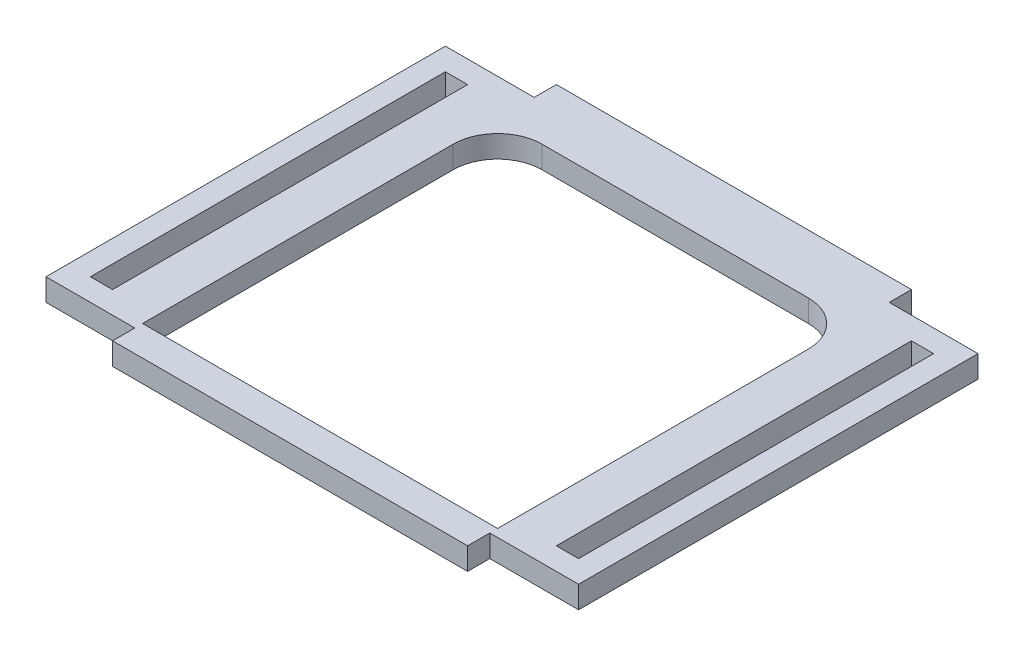
ISO-10303-21;
HEADER;
FILE_DESCRIPTION(('STEP AP214'),'2;1');
FILE_NAME('part.step','',(''),(''),'','','');
FILE_SCHEMA(('AUTOMOTIVE_DESIGN { 1 0 10303 214 1 1 1 1 }'));
ENDSEC;
DATA;
#1=APPLICATION_CONTEXT('core data for automotive mechanical design processes');
#2=APPLICATION_PROTOCOL_DEFINITION('international standard','automotive_design',2000,#1);
#3=PRODUCT_CONTEXT('',#1,'mechanical');
#4=PRODUCT('Part','Part','',(#3));
#5=PRODUCT_RELATED_PRODUCT_CATEGORY('part','',(#4));
#6=PRODUCT_DEFINITION_FORMATION('','',#4);
#7=PRODUCT_DEFINITION_CONTEXT('part definition',#1,'design');
#8=PRODUCT_DEFINITION('design','',#6,#7);
#9=PRODUCT_DEFINITION_SHAPE('','',#8);
#10=(LENGTH_UNIT() NAMED_UNIT(*) SI_UNIT(.MILLI.,.METRE.));
#11=(NAMED_UNIT(*) PLANE_ANGLE_UNIT() SI_UNIT($,.RADIAN.));
#12=(NAMED_UNIT(*) SI_UNIT($,.STERADIAN.) SOLID_ANGLE_UNIT());
#13=UNCERTAINTY_MEASURE_WITH_UNIT(LENGTH_MEASURE(1.E-05),#10,'distance_accuracy_value','');
#14=(GEOMETRIC_REPRESENTATION_CONTEXT(3) GLOBAL_UNCERTAINTY_ASSIGNED_CONTEXT((#13)) GLOBAL_UNIT_ASSIGNED_CONTEXT((#10,
#11,#12)) REPRESENTATION_CONTEXT('',''));
#15=CARTESIAN_POINT('',(0.,0.,0.));
#16=DIRECTION('',(0.,0.,1.));
#17=DIRECTION('',(1.,0.,0.));
#18=AXIS2_PLACEMENT_3D('',#15,#16,#17);
#19=CARTESIAN_POINT('',(76.2,6.35,63.5));
#20=DIRECTION('',(-1.,0.,0.));
#21=DIRECTION('',(0.,0.,1.));
#22=AXIS2_PLACEMENT_3D('',#19,#20,#21);
#23=PLANE('',#22);
#24=DIRECTION('',(0.,0.,-1.));
#25=VECTOR('',#24,1.);
#26=CARTESIAN_POINT('',(76.2,0.,63.5));
#27=LINE('',#26,#25);
#28=CARTESIAN_POINT('',(76.2,0.,57.1500000000001));
#29=VERTEX_POINT('',#28);
#30=CARTESIAN_POINT('',(76.2,0.,-57.1499999999999));
#31=VERTEX_POINT('',#30);
#32=EDGE_CURVE('E401',#29,#31,#27,.T.);
#33=ORIENTED_EDGE('',*,*,#32,.T.);
#34=DIRECTION('',(0.,-1.,0.));
#35=VECTOR('',#34,1.);
#36=CARTESIAN_POINT('',(76.2000000000001,6.35,-57.1499999999999));
#37=LINE('',#36,#35);
#38=CARTESIAN_POINT('',(76.2000000000001,6.35,-57.1499999999999));
#39=VERTEX_POINT('',#38);
#40=EDGE_CURVE('E381',#39,#31,#37,.T.);
#41=ORIENTED_EDGE('',*,*,#40,.F.);
#42=DIRECTION('',(0.,0.,-1.));
#43=VECTOR('',#42,1.);
#44=CARTESIAN_POINT('',(76.2,6.35,63.5));
#45=LINE('',#44,#43);
#46=CARTESIAN_POINT('',(76.2,6.35,57.1500000000001));
#47=VERTEX_POINT('',#46);
#48=EDGE_CURVE('E408',#47,#39,#45,.T.);
#49=ORIENTED_EDGE('',*,*,#48,.F.);
#50=DIRECTION('',(0.,-1.,0.));
#51=VECTOR('',#50,1.);
#52=CARTESIAN_POINT('',(76.2,6.35,57.1500000000001));
#53=LINE('',#52,#51);
#54=EDGE_CURVE('E277',#47,#29,#53,.T.);
#55=ORIENTED_EDGE('',*,*,#54,.T.);
#56=EDGE_LOOP('',(#33,#41,#49,#55));
#57=FACE_BOUND('',#56,.T.);
#58=ADVANCED_FACE('F38',(#57),#23,.F.);
#59=CARTESIAN_POINT('',(-76.2,6.35,-63.5));
#60=DIRECTION('',(0.,0.,1.));
#61=DIRECTION('',(1.,0.,0.));
#62=AXIS2_PLACEMENT_3D('',#59,#60,#61);
#63=PLANE('',#62);
#64=DIRECTION('',(0.,-1.,0.));
#65=VECTOR('',#64,1.);
#66=CARTESIAN_POINT('',(50.8000000000001,6.35,-63.5));
#67=LINE('',#66,#65);
#68=CARTESIAN_POINT('',(50.8000000000001,6.35,-63.5));
#69=VERTEX_POINT('',#68);
#70=CARTESIAN_POINT('',(50.8000000000001,0.,-63.5));
#71=VERTEX_POINT('',#70);
#72=EDGE_CURVE('E295',#69,#71,#67,.T.);
#73=ORIENTED_EDGE('',*,*,#72,.T.);
#74=DIRECTION('',(-1.,0.,0.));
#75=VECTOR('',#74,1.);
#76=CARTESIAN_POINT('',(-76.2,0.,-63.5));
#77=LINE('',#76,#75);
#78=CARTESIAN_POINT('',(-50.8,0.,-63.5));
#79=VERTEX_POINT('',#78);
#80=EDGE_CURVE('E429',#71,#79,#77,.T.);
#81=ORIENTED_EDGE('',*,*,#80,.T.);
#82=DIRECTION('',(0.,-1.,0.));
#83=VECTOR('',#82,1.);
#84=CARTESIAN_POINT('',(-50.8,6.35,-63.5));
#85=LINE('',#84,#83);
#86=CARTESIAN_POINT('',(-50.8,6.35,-63.5));
#87=VERTEX_POINT('',#86);
#88=EDGE_CURVE('E396',#87,#79,#85,.T.);
#89=ORIENTED_EDGE('',*,*,#88,.F.);
#90=DIRECTION('',(-1.,0.,0.));
#91=VECTOR('',#90,1.);
#92=CARTESIAN_POINT('',(-76.2,6.35,-63.5));
#93=LINE('',#92,#91);
#94=EDGE_CURVE('E412',#69,#87,#93,.T.);
#95=ORIENTED_EDGE('',*,*,#94,.F.);
#96=EDGE_LOOP('',(#73,#81,#89,#95));
#97=FACE_BOUND('',#96,.T.);
#98=ADVANCED_FACE('F524',(#97),#63,.F.);
#99=CARTESIAN_POINT('',(-76.2,6.35,63.5));
#100=DIRECTION('',(1.,0.,0.));
#101=DIRECTION('',(0.,0.,-1.));
#102=AXIS2_PLACEMENT_3D('',#99,#100,#101);
#103=PLANE('',#102);
#104=DIRECTION('',(0.,0.,1.));
#105=VECTOR('',#104,1.);
#106=CARTESIAN_POINT('',(-76.2,0.,63.5));
#107=LINE('',#106,#105);
#108=CARTESIAN_POINT('',(-76.2,0.,-57.15));
#109=VERTEX_POINT('',#108);
#110=CARTESIAN_POINT('',(-76.2,0.,57.15));
#111=VERTEX_POINT('',#110);
#112=EDGE_CURVE('E433',#109,#111,#107,.T.);
#113=ORIENTED_EDGE('',*,*,#112,.T.);
#114=DIRECTION('',(0.,-1.,0.));
#115=VECTOR('',#114,1.);
#116=CARTESIAN_POINT('',(-76.2,6.35,57.15));
#117=LINE('',#116,#115);
#118=CARTESIAN_POINT('',(-76.2,6.35,57.15));
#119=VERTEX_POINT('',#118);
#120=EDGE_CURVE('E335',#119,#111,#117,.T.);
#121=ORIENTED_EDGE('',*,*,#120,.F.);
#122=DIRECTION('',(0.,0.,1.));
#123=VECTOR('',#122,1.);
#124=CARTESIAN_POINT('',(-76.2,6.35,63.5));
#125=LINE('',#124,#123);
#126=CARTESIAN_POINT('',(-76.2,6.35,-57.15));
#127=VERTEX_POINT('',#126);
#128=EDGE_CURVE('E417',#127,#119,#125,.T.);
#129=ORIENTED_EDGE('',*,*,#128,.F.);
#130=DIRECTION('',(0.,-1.,0.));
#131=VECTOR('',#130,1.);
#132=CARTESIAN_POINT('',(-76.2,6.35,-57.15));
#133=LINE('',#132,#131);
#134=EDGE_CURVE('E397',#127,#109,#133,.T.);
#135=ORIENTED_EDGE('',*,*,#134,.T.);
#136=EDGE_LOOP('',(#113,#121,#129,#135));
#137=FACE_BOUND('',#136,.T.);
#138=ADVANCED_FACE('F529',(#137),#103,.F.);
#139=CARTESIAN_POINT('',(-76.2,6.35,63.5));
#140=DIRECTION('',(0.,0.,-1.));
#141=DIRECTION('',(-1.,0.,0.));
#142=AXIS2_PLACEMENT_3D('',#139,#140,#141);
#143=PLANE('',#142);
#144=DIRECTION('',(0.,-1.,0.));
#145=VECTOR('',#144,1.);
#146=CARTESIAN_POINT('',(-50.8,6.35,63.5));
#147=LINE('',#146,#145);
#148=CARTESIAN_POINT('',(-50.8,6.35,63.5));
#149=VERTEX_POINT('',#148);
#150=CARTESIAN_POINT('',(-50.8,0.,63.5));
#151=VERTEX_POINT('',#150);
#152=EDGE_CURVE('E331',#149,#151,#147,.T.);
#153=ORIENTED_EDGE('',*,*,#152,.T.);
#154=DIRECTION('',(1.,0.,0.));
#155=VECTOR('',#154,1.);
#156=CARTESIAN_POINT('',(-76.2,0.,63.5));
#157=LINE('',#156,#155);
#158=CARTESIAN_POINT('',(50.7999999999999,0.,63.5));
#159=VERTEX_POINT('',#158);
#160=EDGE_CURVE('E413',#151,#159,#157,.T.);
#161=ORIENTED_EDGE('',*,*,#160,.T.);
#162=DIRECTION('',(0.,-1.,0.));
#163=VECTOR('',#162,1.);
#164=CARTESIAN_POINT('',(50.8,6.35,63.5000000000001));
#165=LINE('',#164,#163);
#166=CARTESIAN_POINT('',(50.8,6.35,63.5000000000001));
#167=VERTEX_POINT('',#166);
#168=EDGE_CURVE('E278',#167,#159,#165,.T.);
#169=ORIENTED_EDGE('',*,*,#168,.F.);
#170=DIRECTION('',(1.,0.,0.));
#171=VECTOR('',#170,1.);
#172=CARTESIAN_POINT('',(-76.2,6.35,63.5));
#173=LINE('',#172,#171);
#174=EDGE_CURVE('E421',#149,#167,#173,.T.);
#175=ORIENTED_EDGE('',*,*,#174,.F.);
#176=EDGE_LOOP('',(#153,#161,#169,#175));
#177=FACE_BOUND('',#176,.T.);
#178=ADVANCED_FACE('F569',(#177),#143,.F.);
#179=CARTESIAN_POINT('',(0.,6.35,0.));
#180=DIRECTION('',(0.,-1.,0.));
#181=DIRECTION('',(0.,0.,-1.));
#182=AXIS2_PLACEMENT_3D('',#179,#180,#181);
#183=PLANE('',#182);
#184=DIRECTION('',(0.,0.,1.));
#185=VECTOR('',#184,1.);
#186=CARTESIAN_POINT('',(-50.8,6.35,0.));
#187=LINE('',#186,#185);
#188=CARTESIAN_POINT('',(-50.8,6.34999999999999,-33.9858167548694));
#189=VERTEX_POINT('',#188);
#190=CARTESIAN_POINT('',(-50.8,6.34999999999999,54.9141832451305));
#191=VERTEX_POINT('',#190);
#192=EDGE_CURVE('E253',#189,#191,#187,.T.);
#193=ORIENTED_EDGE('',*,*,#192,.F.);
#194=CARTESIAN_POINT('',(-38.1,6.34999999999999,-33.9858167548695));
#195=DIRECTION('',(0.,-1.,0.));
#196=DIRECTION('',(0.,0.,-1.));
#197=AXIS2_PLACEMENT_3D('',#194,#195,#196);
#198=CIRCLE('',#197,12.7);
#199=CARTESIAN_POINT('',(-38.1,6.34999999999999,-46.6858167548695));
#200=VERTEX_POINT('',#199);
#201=EDGE_CURVE('E255',#200,#189,#198,.F.);
#202=ORIENTED_EDGE('',*,*,#201,.F.);
#203=DIRECTION('',(-1.,0.,0.));
#204=VECTOR('',#203,1.);
#205=CARTESIAN_POINT('',(0.,6.35,-46.6858167548695));
#206=LINE('',#205,#204);
#207=CARTESIAN_POINT('',(38.0999999999999,6.34999999999999,-46.6858167548695));
#208=VERTEX_POINT('',#207);
#209=EDGE_CURVE('E221',#208,#200,#206,.T.);
#210=ORIENTED_EDGE('',*,*,#209,.F.);
#211=CARTESIAN_POINT('',(38.1,6.34999999999999,-33.9858167548695));
#212=DIRECTION('',(0.,-1.,0.));
#213=DIRECTION('',(0.,0.,-1.));
#214=AXIS2_PLACEMENT_3D('',#211,#212,#213);
#215=CIRCLE('',#214,12.7);
#216=CARTESIAN_POINT('',(50.8,6.34999999999999,-33.9858167548694));
#217=VERTEX_POINT('',#216);
#218=EDGE_CURVE('E266',#217,#208,#215,.F.);
#219=ORIENTED_EDGE('',*,*,#218,.F.);
#220=DIRECTION('',(0.,0.,-1.));
#221=VECTOR('',#220,1.);
#222=CARTESIAN_POINT('',(50.8,6.35,0.));
#223=LINE('',#222,#221);
#224=CARTESIAN_POINT('',(50.8,6.34999999999999,54.9141832451305));
#225=VERTEX_POINT('',#224);
#226=EDGE_CURVE('E269',#225,#217,#223,.T.);
#227=ORIENTED_EDGE('',*,*,#226,.F.);
#228=DIRECTION('',(1.,0.,0.));
#229=VECTOR('',#228,1.);
#230=CARTESIAN_POINT('',(0.,6.35,54.9141832451305));
#231=LINE('',#230,#229);
#232=EDGE_CURVE('E272',#191,#225,#231,.T.);
#233=ORIENTED_EDGE('',*,*,#232,.F.);
#234=EDGE_LOOP('',(#193,#202,#210,#219,#227,#233));
#235=FACE_BOUND('',#234,.T.);
#236=ORIENTED_EDGE('',*,*,#128,.T.);
#237=DIRECTION('',(1.,0.,0.));
#238=VECTOR('',#237,1.);
#239=CARTESIAN_POINT('',(-76.2,6.35,57.15));
#240=LINE('',#239,#238);
#241=CARTESIAN_POINT('',(-50.8,6.35,57.15));
#242=VERTEX_POINT('',#241);
#243=EDGE_CURVE('E301',#119,#242,#240,.T.);
#244=ORIENTED_EDGE('',*,*,#243,.T.);
#245=DIRECTION('',(0.,0.,-1.));
#246=VECTOR('',#245,1.);
#247=CARTESIAN_POINT('',(-50.8,6.35,63.5));
#248=LINE('',#247,#246);
#249=EDGE_CURVE('E330',#149,#242,#248,.T.);
#250=ORIENTED_EDGE('',*,*,#249,.F.);
#251=ORIENTED_EDGE('',*,*,#174,.T.);
#252=DIRECTION('',(0.,0.,-1.));
#253=VECTOR('',#252,1.);
#254=CARTESIAN_POINT('',(50.8,6.35,63.5000000000001));
#255=LINE('',#254,#253);
#256=CARTESIAN_POINT('',(50.8,6.35,57.1500000000001));
#257=VERTEX_POINT('',#256);
#258=EDGE_CURVE('E291',#167,#257,#255,.T.);
#259=ORIENTED_EDGE('',*,*,#258,.T.);
#260=DIRECTION('',(-1.,0.,0.));
#261=VECTOR('',#260,1.);
#262=CARTESIAN_POINT('',(76.2,6.35,57.1500000000001));
#263=LINE('',#262,#261);
#264=EDGE_CURVE('E281',#47,#257,#263,.T.);
#265=ORIENTED_EDGE('',*,*,#264,.F.);
#266=ORIENTED_EDGE('',*,*,#48,.T.);
#267=DIRECTION('',(-1.,0.,0.));
#268=VECTOR('',#267,1.);
#269=CARTESIAN_POINT('',(76.2000000000001,6.35,-57.1499999999999));
#270=LINE('',#269,#268);
#271=CARTESIAN_POINT('',(50.8000000000001,6.35,-57.1499999999999));
#272=VERTEX_POINT('',#271);
#273=EDGE_CURVE('E384',#39,#272,#270,.T.);
#274=ORIENTED_EDGE('',*,*,#273,.T.);
#275=DIRECTION('',(0.,0.,1.));
#276=VECTOR('',#275,1.);
#277=CARTESIAN_POINT('',(50.8000000000001,6.35,-63.5));
#278=LINE('',#277,#276);
#279=EDGE_CURVE('E360',#69,#272,#278,.T.);
#280=ORIENTED_EDGE('',*,*,#279,.F.);
#281=ORIENTED_EDGE('',*,*,#94,.T.);
#282=DIRECTION('',(0.,0.,1.));
#283=VECTOR('',#282,1.);
#284=CARTESIAN_POINT('',(-50.8,6.35,-63.5));
#285=LINE('',#284,#283);
#286=CARTESIAN_POINT('',(-50.8,6.35,-57.15));
#287=VERTEX_POINT('',#286);
#288=EDGE_CURVE('E326',#87,#287,#285,.T.);
#289=ORIENTED_EDGE('',*,*,#288,.T.);
#290=DIRECTION('',(1.,0.,0.));
#291=VECTOR('',#290,1.);
#292=CARTESIAN_POINT('',(-76.2,6.35,-57.15));
#293=LINE('',#292,#291);
#294=EDGE_CURVE('E393',#127,#287,#293,.T.);
#295=ORIENTED_EDGE('',*,*,#294,.F.);
#296=EDGE_LOOP('',(#236,#244,#250,#251,#259,#265,#266,#274,#280,#281,#289,#295));
#297=FACE_BOUND('',#296,.T.);
#298=DIRECTION('',(-1.,0.,0.));
#299=VECTOR('',#298,1.);
#300=CARTESIAN_POINT('',(69.8500000000001,6.35,-50.7999999999999));
#301=LINE('',#300,#299);
#302=CARTESIAN_POINT('',(69.8500000000001,6.35,-50.7999999999999));
#303=VERTEX_POINT('',#302);
#304=CARTESIAN_POINT('',(63.5000000000001,6.35,-50.7999999999999));
#305=VERTEX_POINT('',#304);
#306=EDGE_CURVE('E347',#303,#305,#301,.T.);
#307=ORIENTED_EDGE('',*,*,#306,.F.);
#308=DIRECTION('',(0.,0.,1.));
#309=VECTOR('',#308,1.);
#310=CARTESIAN_POINT('',(69.8500000000001,6.35,-50.7999999999999));
#311=LINE('',#310,#309);
#312=CARTESIAN_POINT('',(69.85,6.35,50.8000000000001));
#313=VERTEX_POINT('',#312);
#314=EDGE_CURVE('E338',#303,#313,#311,.T.);
#315=ORIENTED_EDGE('',*,*,#314,.T.);
#316=DIRECTION('',(-1.,0.,0.));
#317=VECTOR('',#316,1.);
#318=CARTESIAN_POINT('',(69.85,6.35,50.8000000000001));
#319=LINE('',#318,#317);
#320=CARTESIAN_POINT('',(63.5,6.35,50.8000000000001));
#321=VERTEX_POINT('',#320);
#322=EDGE_CURVE('E367',#313,#321,#319,.T.);
#323=ORIENTED_EDGE('',*,*,#322,.T.);
#324=DIRECTION('',(0.,0.,1.));
#325=VECTOR('',#324,1.);
#326=CARTESIAN_POINT('',(63.5000000000001,6.35,-50.7999999999999));
#327=LINE('',#326,#325);
#328=EDGE_CURVE('E363',#305,#321,#327,.T.);
#329=ORIENTED_EDGE('',*,*,#328,.F.);
#330=EDGE_LOOP('',(#307,#315,#323,#329));
#331=FACE_BOUND('',#330,.T.);
#332=DIRECTION('',(1.,0.,0.));
#333=VECTOR('',#332,1.);
#334=CARTESIAN_POINT('',(-69.85,6.35,50.8));
#335=LINE('',#334,#333);
#336=CARTESIAN_POINT('',(-69.85,6.35,50.8));
#337=VERTEX_POINT('',#336);
#338=CARTESIAN_POINT('',(-63.5,6.35,50.8));
#339=VERTEX_POINT('',#338);
#340=EDGE_CURVE('E323',#337,#339,#335,.T.);
#341=ORIENTED_EDGE('',*,*,#340,.F.);
#342=DIRECTION('',(0.,0.,1.));
#343=VECTOR('',#342,1.);
#344=CARTESIAN_POINT('',(-69.85,6.35,-50.8));
#345=LINE('',#344,#343);
#346=CARTESIAN_POINT('',(-69.85,6.35,-50.8));
#347=VERTEX_POINT('',#346);
#348=EDGE_CURVE('E312',#347,#337,#345,.T.);
#349=ORIENTED_EDGE('',*,*,#348,.F.);
#350=DIRECTION('',(1.,0.,0.));
#351=VECTOR('',#350,1.);
#352=CARTESIAN_POINT('',(-69.85,6.35,-50.8));
#353=LINE('',#352,#351);
#354=CARTESIAN_POINT('',(-63.5,6.35,-50.8));
#355=VERTEX_POINT('',#354);
#356=EDGE_CURVE('E315',#347,#355,#353,.T.);
#357=ORIENTED_EDGE('',*,*,#356,.T.);
#358=DIRECTION('',(0.,0.,1.));
#359=VECTOR('',#358,1.);
#360=CARTESIAN_POINT('',(-63.5,6.35,-50.8));
#361=LINE('',#360,#359);
#362=EDGE_CURVE('E319',#355,#339,#361,.T.);
#363=ORIENTED_EDGE('',*,*,#362,.T.);
#364=EDGE_LOOP('',(#341,#349,#357,#363));
#365=FACE_BOUND('',#364,.T.);
#366=ADVANCED_FACE('F507',(#235,#297,#331,#365),#183,.F.);
#367=CARTESIAN_POINT('',(0.,0.,0.));
#368=DIRECTION('',(0.,-1.,0.));
#369=DIRECTION('',(0.,0.,-1.));
#370=AXIS2_PLACEMENT_3D('',#367,#368,#369);
#371=PLANE('',#370);
#372=CARTESIAN_POINT('',(-38.1,0.,-33.9858167548695));
#373=DIRECTION('',(0.,-1.,0.));
#374=DIRECTION('',(0.,0.,-1.));
#375=AXIS2_PLACEMENT_3D('',#372,#373,#374);
#376=CIRCLE('',#375,12.7);
#377=CARTESIAN_POINT('',(-38.0999999999999,0.,-46.6858167548695));
#378=VERTEX_POINT('',#377);
#379=CARTESIAN_POINT('',(-50.8,0.,-33.9858167548694));
#380=VERTEX_POINT('',#379);
#381=EDGE_CURVE('E208',#378,#380,#376,.F.);
#382=ORIENTED_EDGE('',*,*,#381,.T.);
#383=DIRECTION('',(0.,0.,1.));
#384=VECTOR('',#383,1.);
#385=CARTESIAN_POINT('',(-50.8,0.,0.));
#386=LINE('',#385,#384);
#387=CARTESIAN_POINT('',(-50.8,0.,54.9141832451305));
#388=VERTEX_POINT('',#387);
#389=EDGE_CURVE('E11',#380,#388,#386,.T.);
#390=ORIENTED_EDGE('',*,*,#389,.T.);
#391=DIRECTION('',(1.,0.,0.));
#392=VECTOR('',#391,1.);
#393=CARTESIAN_POINT('',(0.,0.,54.9141832451305));
#394=LINE('',#393,#392);
#395=CARTESIAN_POINT('',(50.8,0.,54.9141832451305));
#396=VERTEX_POINT('',#395);
#397=EDGE_CURVE('E46',#388,#396,#394,.T.);
#398=ORIENTED_EDGE('',*,*,#397,.T.);
#399=DIRECTION('',(0.,0.,-1.));
#400=VECTOR('',#399,1.);
#401=CARTESIAN_POINT('',(50.8,0.,0.));
#402=LINE('',#401,#400);
#403=CARTESIAN_POINT('',(50.8,0.,-33.9858167548694));
#404=VERTEX_POINT('',#403);
#405=EDGE_CURVE('E234',#396,#404,#402,.T.);
#406=ORIENTED_EDGE('',*,*,#405,.T.);
#407=CARTESIAN_POINT('',(38.1,0.,-33.9858167548695));
#408=DIRECTION('',(0.,-1.,0.));
#409=DIRECTION('',(0.,0.,-1.));
#410=AXIS2_PLACEMENT_3D('',#407,#408,#409);
#411=CIRCLE('',#410,12.7);
#412=CARTESIAN_POINT('',(38.0999999999999,0.,-46.6858167548695));
#413=VERTEX_POINT('',#412);
#414=EDGE_CURVE('E230',#404,#413,#411,.F.);
#415=ORIENTED_EDGE('',*,*,#414,.T.);
#416=DIRECTION('',(-1.,0.,0.));
#417=VECTOR('',#416,1.);
#418=CARTESIAN_POINT('',(0.,0.,-46.6858167548695));
#419=LINE('',#418,#417);
#420=EDGE_CURVE('E213',#413,#378,#419,.T.);
#421=ORIENTED_EDGE('',*,*,#420,.T.);
#422=EDGE_LOOP('',(#382,#390,#398,#406,#415,#421));
#423=FACE_BOUND('',#422,.T.);
#424=DIRECTION('',(1.,0.,0.));
#425=VECTOR('',#424,1.);
#426=CARTESIAN_POINT('',(0.,0.,57.15));
#427=LINE('',#426,#425);
#428=CARTESIAN_POINT('',(-50.8,0.,57.15));
#429=VERTEX_POINT('',#428);
#430=EDGE_CURVE('E479',#111,#429,#427,.T.);
#431=ORIENTED_EDGE('',*,*,#430,.F.);
#432=ORIENTED_EDGE('',*,*,#112,.F.);
#433=DIRECTION('',(1.,0.,0.));
#434=VECTOR('',#433,1.);
#435=CARTESIAN_POINT('',(0.,0.,-57.15));
#436=LINE('',#435,#434);
#437=CARTESIAN_POINT('',(-50.8,0.,-57.15));
#438=VERTEX_POINT('',#437);
#439=EDGE_CURVE('E442',#109,#438,#436,.T.);
#440=ORIENTED_EDGE('',*,*,#439,.T.);
#441=DIRECTION('',(0.,0.,1.));
#442=VECTOR('',#441,1.);
#443=CARTESIAN_POINT('',(-50.8,0.,0.));
#444=LINE('',#443,#442);
#445=EDGE_CURVE('E425',#79,#438,#444,.T.);
#446=ORIENTED_EDGE('',*,*,#445,.F.);
#447=ORIENTED_EDGE('',*,*,#80,.F.);
#448=DIRECTION('',(0.,0.,1.));
#449=VECTOR('',#448,1.);
#450=CARTESIAN_POINT('',(50.8000000000001,0.,0.));
#451=LINE('',#450,#449);
#452=CARTESIAN_POINT('',(50.8000000000001,0.,-57.1499999999999));
#453=VERTEX_POINT('',#452);
#454=EDGE_CURVE('E456',#71,#453,#451,.T.);
#455=ORIENTED_EDGE('',*,*,#454,.T.);
#456=DIRECTION('',(-1.,0.,0.));
#457=VECTOR('',#456,1.);
#458=CARTESIAN_POINT('',(0.,0.,-57.15));
#459=LINE('',#458,#457);
#460=EDGE_CURVE('E453',#31,#453,#459,.T.);
#461=ORIENTED_EDGE('',*,*,#460,.F.);
#462=ORIENTED_EDGE('',*,*,#32,.F.);
#463=DIRECTION('',(-1.,0.,0.));
#464=VECTOR('',#463,1.);
#465=CARTESIAN_POINT('',(0.,0.,57.1500000000001));
#466=LINE('',#465,#464);
#467=CARTESIAN_POINT('',(50.8,0.,57.1500000000001));
#468=VERTEX_POINT('',#467);
#469=EDGE_CURVE('E449',#29,#468,#466,.T.);
#470=ORIENTED_EDGE('',*,*,#469,.T.);
#471=DIRECTION('',(0.,0.,-1.));
#472=VECTOR('',#471,1.);
#473=CARTESIAN_POINT('',(50.8,0.,0.));
#474=LINE('',#473,#472);
#475=EDGE_CURVE('E446',#159,#468,#474,.T.);
#476=ORIENTED_EDGE('',*,*,#475,.F.);
#477=ORIENTED_EDGE('',*,*,#160,.F.);
#478=DIRECTION('',(0.,0.,-1.));
#479=VECTOR('',#478,1.);
#480=CARTESIAN_POINT('',(-50.8,0.,0.));
#481=LINE('',#480,#479);
#482=EDGE_CURVE('E475',#151,#429,#481,.T.);
#483=ORIENTED_EDGE('',*,*,#482,.T.);
#484=EDGE_LOOP('',(#431,#432,#440,#446,#447,#455,#461,#462,#470,#476,#477,#483));
#485=FACE_BOUND('',#484,.T.);
#486=DIRECTION('',(0.,0.,1.));
#487=VECTOR('',#486,1.);
#488=CARTESIAN_POINT('',(69.85,0.,0.));
#489=LINE('',#488,#487);
#490=CARTESIAN_POINT('',(69.8500000000001,0.,-50.7999999999999));
#491=VERTEX_POINT('',#490);
#492=CARTESIAN_POINT('',(69.85,0.,50.8000000000001));
#493=VERTEX_POINT('',#492);
#494=EDGE_CURVE('E471',#491,#493,#489,.T.);
#495=ORIENTED_EDGE('',*,*,#494,.F.);
#496=DIRECTION('',(-1.,0.,0.));
#497=VECTOR('',#496,1.);
#498=CARTESIAN_POINT('',(0.,0.,-50.8));
#499=LINE('',#498,#497);
#500=CARTESIAN_POINT('',(63.5000000000001,0.,-50.7999999999999));
#501=VERTEX_POINT('',#500);
#502=EDGE_CURVE('E467',#491,#501,#499,.T.);
#503=ORIENTED_EDGE('',*,*,#502,.T.);
#504=DIRECTION('',(0.,0.,1.));
#505=VECTOR('',#504,1.);
#506=CARTESIAN_POINT('',(63.5,0.,0.));
#507=LINE('',#506,#505);
#508=CARTESIAN_POINT('',(63.5,0.,50.8000000000001));
#509=VERTEX_POINT('',#508);
#510=EDGE_CURVE('E463',#501,#509,#507,.T.);
#511=ORIENTED_EDGE('',*,*,#510,.T.);
#512=DIRECTION('',(-1.,0.,0.));
#513=VECTOR('',#512,1.);
#514=CARTESIAN_POINT('',(0.,0.,50.8000000000001));
#515=LINE('',#514,#513);
#516=EDGE_CURVE('E460',#493,#509,#515,.T.);
#517=ORIENTED_EDGE('',*,*,#516,.F.);
#518=EDGE_LOOP('',(#495,#503,#511,#517));
#519=FACE_BOUND('',#518,.T.);
#520=DIRECTION('',(0.,0.,1.));
#521=VECTOR('',#520,1.);
#522=CARTESIAN_POINT('',(-69.85,0.,0.));
#523=LINE('',#522,#521);
#524=CARTESIAN_POINT('',(-69.85,0.,-50.8));
#525=VERTEX_POINT('',#524);
#526=CARTESIAN_POINT('',(-69.85,0.,50.8));
#527=VERTEX_POINT('',#526);
#528=EDGE_CURVE('E483',#525,#527,#523,.T.);
#529=ORIENTED_EDGE('',*,*,#528,.T.);
#530=DIRECTION('',(1.,0.,0.));
#531=VECTOR('',#530,1.);
#532=CARTESIAN_POINT('',(0.,0.,50.8));
#533=LINE('',#532,#531);
#534=CARTESIAN_POINT('',(-63.5,0.,50.8));
#535=VERTEX_POINT('',#534);
#536=EDGE_CURVE('E214',#527,#535,#533,.T.);
#537=ORIENTED_EDGE('',*,*,#536,.T.);
#538=DIRECTION('',(0.,0.,1.));
#539=VECTOR('',#538,1.);
#540=CARTESIAN_POINT('',(-63.5,0.,0.));
#541=LINE('',#540,#539);
#542=CARTESIAN_POINT('',(-63.5,0.,-50.8));
#543=VERTEX_POINT('',#542);
#544=EDGE_CURVE('E490',#543,#535,#541,.T.);
#545=ORIENTED_EDGE('',*,*,#544,.F.);
#546=DIRECTION('',(1.,0.,0.));
#547=VECTOR('',#546,1.);
#548=CARTESIAN_POINT('',(0.,0.,-50.8));
#549=LINE('',#548,#547);
#550=EDGE_CURVE('E487',#525,#543,#549,.T.);
#551=ORIENTED_EDGE('',*,*,#550,.F.);
#552=EDGE_LOOP('',(#529,#537,#545,#551));
#553=FACE_BOUND('',#552,.T.);
#554=ADVANCED_FACE('F227',(#423,#485,#519,#553),#371,.T.);
#555=CARTESIAN_POINT('',(-76.2,6.35,-57.15));
#556=DIRECTION('',(0.,0.,-1.));
#557=DIRECTION('',(-1.,0.,0.));
#558=AXIS2_PLACEMENT_3D('',#555,#556,#557);
#559=PLANE('',#558);
#560=ORIENTED_EDGE('',*,*,#134,.F.);
#561=ORIENTED_EDGE('',*,*,#294,.T.);
#562=DIRECTION('',(0.,-1.,0.));
#563=VECTOR('',#562,1.);
#564=CARTESIAN_POINT('',(-50.8,6.35,-57.15));
#565=LINE('',#564,#563);
#566=EDGE_CURVE('E402',#287,#438,#565,.T.);
#567=ORIENTED_EDGE('',*,*,#566,.T.);
#568=ORIENTED_EDGE('',*,*,#439,.F.);
#569=EDGE_LOOP('',(#560,#561,#567,#568));
#570=FACE_BOUND('',#569,.T.);
#571=ADVANCED_FACE('F555',(#570),#559,.T.);
#572=CARTESIAN_POINT('',(-50.8,6.35,-63.5));
#573=DIRECTION('',(1.,0.,0.));
#574=DIRECTION('',(0.,0.,-1.));
#575=AXIS2_PLACEMENT_3D('',#572,#573,#574);
#576=PLANE('',#575);
#577=ORIENTED_EDGE('',*,*,#445,.T.);
#578=ORIENTED_EDGE('',*,*,#566,.F.);
#579=ORIENTED_EDGE('',*,*,#288,.F.);
#580=ORIENTED_EDGE('',*,*,#88,.T.);
#581=EDGE_LOOP('',(#577,#578,#579,#580));
#582=FACE_BOUND('',#581,.T.);
#583=ADVANCED_FACE('F551',(#582),#576,.F.);
#584=CARTESIAN_POINT('',(76.2,6.35,57.1500000000001));
#585=DIRECTION('',(0.,0.,1.));
#586=DIRECTION('',(1.,0.,0.));
#587=AXIS2_PLACEMENT_3D('',#584,#585,#586);
#588=PLANE('',#587);
#589=ORIENTED_EDGE('',*,*,#54,.F.);
#590=ORIENTED_EDGE('',*,*,#264,.T.);
#591=DIRECTION('',(0.,-1.,0.));
#592=VECTOR('',#591,1.);
#593=CARTESIAN_POINT('',(50.8,6.35,57.1500000000001));
#594=LINE('',#593,#592);
#595=EDGE_CURVE('E282',#257,#468,#594,.T.);
#596=ORIENTED_EDGE('',*,*,#595,.T.);
#597=ORIENTED_EDGE('',*,*,#469,.F.);
#598=EDGE_LOOP('',(#589,#590,#596,#597));
#599=FACE_BOUND('',#598,.T.);
#600=ADVANCED_FACE('F575',(#599),#588,.T.);
#601=CARTESIAN_POINT('',(50.8,6.35,63.5000000000001));
#602=DIRECTION('',(-1.,0.,0.));
#603=DIRECTION('',(0.,0.,1.));
#604=AXIS2_PLACEMENT_3D('',#601,#602,#603);
#605=PLANE('',#604);
#606=ORIENTED_EDGE('',*,*,#475,.T.);
#607=ORIENTED_EDGE('',*,*,#595,.F.);
#608=ORIENTED_EDGE('',*,*,#258,.F.);
#609=ORIENTED_EDGE('',*,*,#168,.T.);
#610=EDGE_LOOP('',(#606,#607,#608,#609));
#611=FACE_BOUND('',#610,.T.);
#612=ADVANCED_FACE('F573',(#611),#605,.F.);
#613=CARTESIAN_POINT('',(50.8000000000001,6.35,-63.5));
#614=DIRECTION('',(1.,0.,0.));
#615=DIRECTION('',(0.,0.,-1.));
#616=AXIS2_PLACEMENT_3D('',#613,#614,#615);
#617=PLANE('',#616);
#618=ORIENTED_EDGE('',*,*,#72,.F.);
#619=ORIENTED_EDGE('',*,*,#279,.T.);
#620=DIRECTION('',(0.,-1.,0.));
#621=VECTOR('',#620,1.);
#622=CARTESIAN_POINT('',(50.8000000000001,6.35,-57.1499999999999));
#623=LINE('',#622,#621);
#624=EDGE_CURVE('E377',#272,#453,#623,.T.);
#625=ORIENTED_EDGE('',*,*,#624,.T.);
#626=ORIENTED_EDGE('',*,*,#454,.F.);
#627=EDGE_LOOP('',(#618,#619,#625,#626));
#628=FACE_BOUND('',#627,.T.);
#629=ADVANCED_FACE('F543',(#628),#617,.T.);
#630=CARTESIAN_POINT('',(76.2000000000001,6.35,-57.1499999999999));
#631=DIRECTION('',(0.,0.,1.));
#632=DIRECTION('',(1.,0.,0.));
#633=AXIS2_PLACEMENT_3D('',#630,#631,#632);
#634=PLANE('',#633);
#635=ORIENTED_EDGE('',*,*,#460,.T.);
#636=ORIENTED_EDGE('',*,*,#624,.F.);
#637=ORIENTED_EDGE('',*,*,#273,.F.);
#638=ORIENTED_EDGE('',*,*,#40,.T.);
#639=EDGE_LOOP('',(#635,#636,#637,#638));
#640=FACE_BOUND('',#639,.T.);
#641=ADVANCED_FACE('F541',(#640),#634,.F.);
#642=CARTESIAN_POINT('',(69.8500000000001,6.35,-50.7999999999999));
#643=DIRECTION('',(1.,0.,0.));
#644=DIRECTION('',(0.,0.,-1.));
#645=AXIS2_PLACEMENT_3D('',#642,#643,#644);
#646=PLANE('',#645);
#647=ORIENTED_EDGE('',*,*,#494,.T.);
#648=DIRECTION('',(0.,-1.,0.));
#649=VECTOR('',#648,1.);
#650=CARTESIAN_POINT('',(69.85,6.35,50.8000000000001));
#651=LINE('',#650,#649);
#652=EDGE_CURVE('E344',#313,#493,#651,.T.);
#653=ORIENTED_EDGE('',*,*,#652,.F.);
#654=ORIENTED_EDGE('',*,*,#314,.F.);
#655=DIRECTION('',(0.,-1.,0.));
#656=VECTOR('',#655,1.);
#657=CARTESIAN_POINT('',(69.8500000000001,6.35,-50.7999999999999));
#658=LINE('',#657,#656);
#659=EDGE_CURVE('E356',#303,#491,#658,.T.);
#660=ORIENTED_EDGE('',*,*,#659,.T.);
#661=EDGE_LOOP('',(#647,#653,#654,#660));
#662=FACE_BOUND('',#661,.T.);
#663=ADVANCED_FACE('F742',(#662),#646,.F.);
#664=CARTESIAN_POINT('',(69.8500000000001,6.35,-50.7999999999999));
#665=DIRECTION('',(0.,0.,1.));
#666=DIRECTION('',(1.,0.,0.));
#667=AXIS2_PLACEMENT_3D('',#664,#665,#666);
#668=PLANE('',#667);
#669=ORIENTED_EDGE('',*,*,#659,.F.);
#670=ORIENTED_EDGE('',*,*,#306,.T.);
#671=DIRECTION('',(0.,-1.,0.));
#672=VECTOR('',#671,1.);
#673=CARTESIAN_POINT('',(63.5000000000001,6.35,-50.7999999999999));
#674=LINE('',#673,#672);
#675=EDGE_CURVE('E352',#305,#501,#674,.T.);
#676=ORIENTED_EDGE('',*,*,#675,.T.);
#677=ORIENTED_EDGE('',*,*,#502,.F.);
#678=EDGE_LOOP('',(#669,#670,#676,#677));
#679=FACE_BOUND('',#678,.T.);
#680=ADVANCED_FACE('F750',(#679),#668,.T.);
#681=CARTESIAN_POINT('',(63.5000000000001,6.35,-50.7999999999999));
#682=DIRECTION('',(1.,0.,0.));
#683=DIRECTION('',(0.,0.,-1.));
#684=AXIS2_PLACEMENT_3D('',#681,#682,#683);
#685=PLANE('',#684);
#686=ORIENTED_EDGE('',*,*,#675,.F.);
#687=ORIENTED_EDGE('',*,*,#328,.T.);
#688=DIRECTION('',(0.,-1.,0.));
#689=VECTOR('',#688,1.);
#690=CARTESIAN_POINT('',(63.5,6.35,50.8000000000001));
#691=LINE('',#690,#689);
#692=EDGE_CURVE('E348',#321,#509,#691,.T.);
#693=ORIENTED_EDGE('',*,*,#692,.T.);
#694=ORIENTED_EDGE('',*,*,#510,.F.);
#695=EDGE_LOOP('',(#686,#687,#693,#694));
#696=FACE_BOUND('',#695,.T.);
#697=ADVANCED_FACE('F759',(#696),#685,.T.);
#698=CARTESIAN_POINT('',(69.85,6.35,50.8000000000001));
#699=DIRECTION('',(0.,0.,1.));
#700=DIRECTION('',(1.,0.,0.));
#701=AXIS2_PLACEMENT_3D('',#698,#699,#700);
#702=PLANE('',#701);
#703=ORIENTED_EDGE('',*,*,#516,.T.);
#704=ORIENTED_EDGE('',*,*,#692,.F.);
#705=ORIENTED_EDGE('',*,*,#322,.F.);
#706=ORIENTED_EDGE('',*,*,#652,.T.);
#707=EDGE_LOOP('',(#703,#704,#705,#706));
#708=FACE_BOUND('',#707,.T.);
#709=ADVANCED_FACE('F768',(#708),#702,.F.);
#710=CARTESIAN_POINT('',(-76.2,6.35,57.15));
#711=DIRECTION('',(0.,0.,-1.));
#712=DIRECTION('',(-1.,0.,0.));
#713=AXIS2_PLACEMENT_3D('',#710,#711,#712);
#714=PLANE('',#713);
#715=ORIENTED_EDGE('',*,*,#430,.T.);
#716=DIRECTION('',(0.,-1.,0.));
#717=VECTOR('',#716,1.);
#718=CARTESIAN_POINT('',(-50.8,6.35,57.15));
#719=LINE('',#718,#717);
#720=EDGE_CURVE('E327',#242,#429,#719,.T.);
#721=ORIENTED_EDGE('',*,*,#720,.F.);
#722=ORIENTED_EDGE('',*,*,#243,.F.);
#723=ORIENTED_EDGE('',*,*,#120,.T.);
#724=EDGE_LOOP('',(#715,#721,#722,#723));
#725=FACE_BOUND('',#724,.T.);
#726=ADVANCED_FACE('F564',(#725),#714,.F.);
#727=CARTESIAN_POINT('',(-50.8,6.35,63.5));
#728=DIRECTION('',(-1.,0.,0.));
#729=DIRECTION('',(0.,0.,1.));
#730=AXIS2_PLACEMENT_3D('',#727,#728,#729);
#731=PLANE('',#730);
#732=ORIENTED_EDGE('',*,*,#152,.F.);
#733=ORIENTED_EDGE('',*,*,#249,.T.);
#734=ORIENTED_EDGE('',*,*,#720,.T.);
#735=ORIENTED_EDGE('',*,*,#482,.F.);
#736=EDGE_LOOP('',(#732,#733,#734,#735));
#737=FACE_BOUND('',#736,.T.);
#738=ADVANCED_FACE('F566',(#737),#731,.T.);
#739=CARTESIAN_POINT('',(-69.85,6.35,50.8));
#740=DIRECTION('',(0.,0.,-1.));
#741=DIRECTION('',(-1.,0.,0.));
#742=AXIS2_PLACEMENT_3D('',#739,#740,#741);
#743=PLANE('',#742);
#744=DIRECTION('',(0.,-1.,0.));
#745=VECTOR('',#744,1.);
#746=CARTESIAN_POINT('',(-69.85,6.35,50.8));
#747=LINE('',#746,#745);
#748=EDGE_CURVE('E309',#337,#527,#747,.T.);
#749=ORIENTED_EDGE('',*,*,#748,.F.);
#750=ORIENTED_EDGE('',*,*,#340,.T.);
#751=DIRECTION('',(0.,-1.,0.));
#752=VECTOR('',#751,1.);
#753=CARTESIAN_POINT('',(-63.5,6.35,50.8));
#754=LINE('',#753,#752);
#755=EDGE_CURVE('E296',#339,#535,#754,.T.);
#756=ORIENTED_EDGE('',*,*,#755,.T.);
#757=ORIENTED_EDGE('',*,*,#536,.F.);
#758=EDGE_LOOP('',(#749,#750,#756,#757));
#759=FACE_BOUND('',#758,.T.);
#760=ADVANCED_FACE('F500',(#759),#743,.T.);
#761=CARTESIAN_POINT('',(-63.5,6.35,-50.8));
#762=DIRECTION('',(1.,0.,0.));
#763=DIRECTION('',(0.,0.,-1.));
#764=AXIS2_PLACEMENT_3D('',#761,#762,#763);
#765=PLANE('',#764);
#766=ORIENTED_EDGE('',*,*,#544,.T.);
#767=ORIENTED_EDGE('',*,*,#755,.F.);
#768=ORIENTED_EDGE('',*,*,#362,.F.);
#769=DIRECTION('',(0.,-1.,0.));
#770=VECTOR('',#769,1.);
#771=CARTESIAN_POINT('',(-63.5,6.35,-50.8));
#772=LINE('',#771,#770);
#773=EDGE_CURVE('E300',#355,#543,#772,.T.);
#774=ORIENTED_EDGE('',*,*,#773,.T.);
#775=EDGE_LOOP('',(#766,#767,#768,#774));
#776=FACE_BOUND('',#775,.T.);
#777=ADVANCED_FACE('F505',(#776),#765,.F.);
#778=CARTESIAN_POINT('',(-69.85,6.35,-50.8));
#779=DIRECTION('',(0.,0.,-1.));
#780=DIRECTION('',(-1.,0.,0.));
#781=AXIS2_PLACEMENT_3D('',#778,#779,#780);
#782=PLANE('',#781);
#783=ORIENTED_EDGE('',*,*,#550,.T.);
#784=ORIENTED_EDGE('',*,*,#773,.F.);
#785=ORIENTED_EDGE('',*,*,#356,.F.);
#786=DIRECTION('',(0.,-1.,0.));
#787=VECTOR('',#786,1.);
#788=CARTESIAN_POINT('',(-69.85,6.35,-50.8));
#789=LINE('',#788,#787);
#790=EDGE_CURVE('E305',#347,#525,#789,.T.);
#791=ORIENTED_EDGE('',*,*,#790,.T.);
#792=EDGE_LOOP('',(#783,#784,#785,#791));
#793=FACE_BOUND('',#792,.T.);
#794=ADVANCED_FACE('F511',(#793),#782,.F.);
#795=CARTESIAN_POINT('',(-69.85,6.35,-50.8));
#796=DIRECTION('',(1.,0.,0.));
#797=DIRECTION('',(0.,0.,-1.));
#798=AXIS2_PLACEMENT_3D('',#795,#796,#797);
#799=PLANE('',#798);
#800=ORIENTED_EDGE('',*,*,#790,.F.);
#801=ORIENTED_EDGE('',*,*,#348,.T.);
#802=ORIENTED_EDGE('',*,*,#748,.T.);
#803=ORIENTED_EDGE('',*,*,#528,.F.);
#804=EDGE_LOOP('',(#800,#801,#802,#803));
#805=FACE_BOUND('',#804,.T.);
#806=ADVANCED_FACE('F513',(#805),#799,.T.);
#807=CARTESIAN_POINT('',(-50.8,127.,54.9141832451305));
#808=DIRECTION('',(1.,0.,0.));
#809=DIRECTION('',(0.,0.,-1.));
#810=AXIS2_PLACEMENT_3D('',#807,#808,#809);
#811=PLANE('',#810);
#812=ORIENTED_EDGE('',*,*,#192,.T.);
#813=DIRECTION('',(0.,-1.,0.));
#814=VECTOR('',#813,1.);
#815=CARTESIAN_POINT('',(-50.8,127.,54.9141832451305));
#816=LINE('',#815,#814);
#817=EDGE_CURVE('E246',#191,#388,#816,.T.);
#818=ORIENTED_EDGE('',*,*,#817,.T.);
#819=ORIENTED_EDGE('',*,*,#389,.F.);
#820=DIRECTION('',(0.,-1.,0.));
#821=VECTOR('',#820,1.);
#822=CARTESIAN_POINT('',(-50.8,127.,-33.9858167548694));
#823=LINE('',#822,#821);
#824=EDGE_CURVE('E58',#189,#380,#823,.T.);
#825=ORIENTED_EDGE('',*,*,#824,.F.);
#826=EDGE_LOOP('',(#812,#818,#819,#825));
#827=FACE_BOUND('',#826,.T.);
#828=ADVANCED_FACE('F251',(#827),#811,.T.);
#829=CARTESIAN_POINT('',(-50.8,127.,54.9141832451305));
#830=DIRECTION('',(0.,0.,-1.));
#831=DIRECTION('',(-1.,0.,0.));
#832=AXIS2_PLACEMENT_3D('',#829,#830,#831);
#833=PLANE('',#832);
#834=ORIENTED_EDGE('',*,*,#232,.T.);
#835=DIRECTION('',(0.,-1.,0.));
#836=VECTOR('',#835,1.);
#837=CARTESIAN_POINT('',(50.8,127.,54.9141832451305));
#838=LINE('',#837,#836);
#839=EDGE_CURVE('E249',#225,#396,#838,.T.);
#840=ORIENTED_EDGE('',*,*,#839,.T.);
#841=ORIENTED_EDGE('',*,*,#397,.F.);
#842=ORIENTED_EDGE('',*,*,#817,.F.);
#843=EDGE_LOOP('',(#834,#840,#841,#842));
#844=FACE_BOUND('',#843,.T.);
#845=ADVANCED_FACE('F245',(#844),#833,.T.);
#846=CARTESIAN_POINT('',(50.8,127.,54.9141832451305));
#847=DIRECTION('',(-1.,0.,0.));
#848=DIRECTION('',(0.,0.,1.));
#849=AXIS2_PLACEMENT_3D('',#846,#847,#848);
#850=PLANE('',#849);
#851=ORIENTED_EDGE('',*,*,#226,.T.);
#852=DIRECTION('',(0.,-1.,0.));
#853=VECTOR('',#852,1.);
#854=CARTESIAN_POINT('',(50.8,127.,-33.9858167548694));
#855=LINE('',#854,#853);
#856=EDGE_CURVE('E260',#217,#404,#855,.T.);
#857=ORIENTED_EDGE('',*,*,#856,.T.);
#858=ORIENTED_EDGE('',*,*,#405,.F.);
#859=ORIENTED_EDGE('',*,*,#839,.F.);
#860=EDGE_LOOP('',(#851,#857,#858,#859));
#861=FACE_BOUND('',#860,.T.);
#862=ADVANCED_FACE('F631',(#861),#850,.T.);
#863=CARTESIAN_POINT('',(38.1,127.,-33.9858167548695));
#864=DIRECTION('',(0.,-1.,0.));
#865=DIRECTION('',(0.,0.,-1.));
#866=AXIS2_PLACEMENT_3D('',#863,#864,#865);
#867=CYLINDRICAL_SURFACE('',#866,12.7);
#868=ORIENTED_EDGE('',*,*,#218,.T.);
#869=DIRECTION('',(0.,-1.,0.));
#870=VECTOR('',#869,1.);
#871=CARTESIAN_POINT('',(38.0999999999999,127.,-46.6858167548695));
#872=LINE('',#871,#870);
#873=EDGE_CURVE('E224',#208,#413,#872,.T.);
#874=ORIENTED_EDGE('',*,*,#873,.T.);
#875=ORIENTED_EDGE('',*,*,#414,.F.);
#876=ORIENTED_EDGE('',*,*,#856,.F.);
#877=EDGE_LOOP('',(#868,#874,#875,#876));
#878=FACE_BOUND('',#877,.T.);
#879=ADVANCED_FACE('F640',(#878),#867,.F.);
#880=CARTESIAN_POINT('',(-38.0999999999999,127.,-46.6858167548695));
#881=DIRECTION('',(0.,0.,1.));
#882=DIRECTION('',(1.,0.,0.));
#883=AXIS2_PLACEMENT_3D('',#880,#881,#882);
#884=PLANE('',#883);
#885=ORIENTED_EDGE('',*,*,#209,.T.);
#886=DIRECTION('',(0.,-1.,0.));
#887=VECTOR('',#886,1.);
#888=CARTESIAN_POINT('',(-38.0999999999999,127.,-46.6858167548695));
#889=LINE('',#888,#887);
#890=EDGE_CURVE('E53',#200,#378,#889,.T.);
#891=ORIENTED_EDGE('',*,*,#890,.T.);
#892=ORIENTED_EDGE('',*,*,#420,.F.);
#893=ORIENTED_EDGE('',*,*,#873,.F.);
#894=EDGE_LOOP('',(#885,#891,#892,#893));
#895=FACE_BOUND('',#894,.T.);
#896=ADVANCED_FACE('F217',(#895),#884,.T.);
#897=CARTESIAN_POINT('',(-38.1,127.,-33.9858167548695));
#898=DIRECTION('',(0.,-1.,0.));
#899=DIRECTION('',(0.,0.,-1.));
#900=AXIS2_PLACEMENT_3D('',#897,#898,#899);
#901=CYLINDRICAL_SURFACE('',#900,12.7);
#902=ORIENTED_EDGE('',*,*,#201,.T.);
#903=ORIENTED_EDGE('',*,*,#824,.T.);
#904=ORIENTED_EDGE('',*,*,#381,.F.);
#905=ORIENTED_EDGE('',*,*,#890,.F.);
#906=EDGE_LOOP('',(#902,#903,#904,#905));
#907=FACE_BOUND('',#906,.T.);
#908=ADVANCED_FACE('F209',(#907),#901,.F.);
#909=CLOSED_SHELL('',(#58,#98,#138,#178,#366,#554,#571,#583,#600,#612,#629,#641,#663,#680,#697,
#709,#726,#738,#760,#777,#794,#806,#828,#845,#862,#879,#896,#908));
#910=MANIFOLD_SOLID_BREP('B2',#909);
#911=ADVANCED_BREP_SHAPE_REPRESENTATION('',(#18,#910),#14);
#912=SHAPE_DEFINITION_REPRESENTATION(#9,#911);
ENDSEC;
END-ISO-10303-21;
